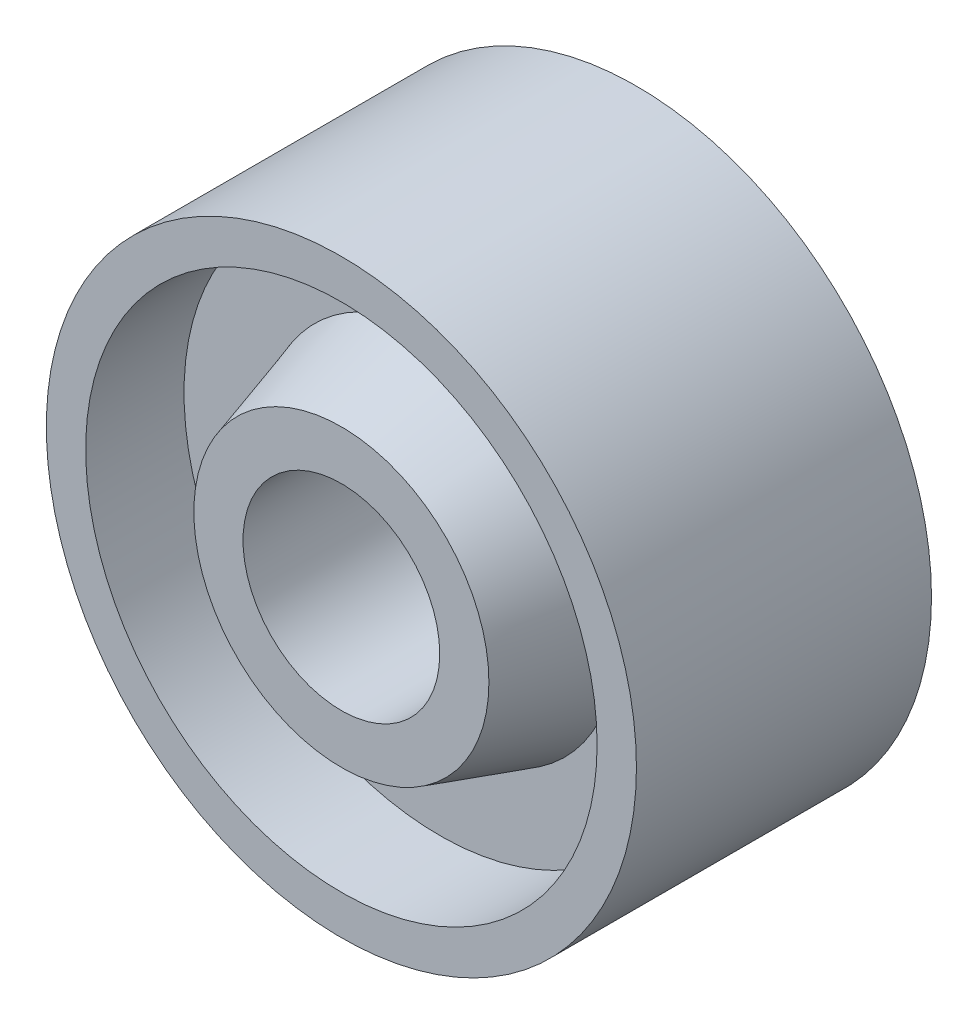
ISO-10303-21;
HEADER;
FILE_DESCRIPTION(('STEP AP214'),'2;1');
FILE_NAME('part.step','',(''),(''),'','','');
FILE_SCHEMA(('AUTOMOTIVE_DESIGN { 1 0 10303 214 1 1 1 1 }'));
ENDSEC;
DATA;
#1=APPLICATION_CONTEXT('core data for automotive mechanical design processes');
#2=APPLICATION_PROTOCOL_DEFINITION('international standard','automotive_design',2000,#1);
#3=PRODUCT_CONTEXT('',#1,'mechanical');
#4=PRODUCT('Part','Part','',(#3));
#5=PRODUCT_RELATED_PRODUCT_CATEGORY('part','',(#4));
#6=PRODUCT_DEFINITION_FORMATION('','',#4);
#7=PRODUCT_DEFINITION_CONTEXT('part definition',#1,'design');
#8=PRODUCT_DEFINITION('design','',#6,#7);
#9=PRODUCT_DEFINITION_SHAPE('','',#8);
#10=(LENGTH_UNIT() NAMED_UNIT(*) SI_UNIT(.MILLI.,.METRE.));
#11=(NAMED_UNIT(*) PLANE_ANGLE_UNIT() SI_UNIT($,.RADIAN.));
#12=(NAMED_UNIT(*) SI_UNIT($,.STERADIAN.) SOLID_ANGLE_UNIT());
#13=UNCERTAINTY_MEASURE_WITH_UNIT(LENGTH_MEASURE(1.E-05),#10,'distance_accuracy_value','');
#14=(GEOMETRIC_REPRESENTATION_CONTEXT(3) GLOBAL_UNCERTAINTY_ASSIGNED_CONTEXT((#13)) GLOBAL_UNIT_ASSIGNED_CONTEXT((#10,
#11,#12)) REPRESENTATION_CONTEXT('',''));
#15=CARTESIAN_POINT('',(0.,0.,0.));
#16=DIRECTION('',(0.,0.,1.));
#17=DIRECTION('',(1.,0.,0.));
#18=AXIS2_PLACEMENT_3D('',#15,#16,#17);
#19=CARTESIAN_POINT('',(0.,0.,-30.));
#20=DIRECTION('',(0.,0.,1.));
#21=DIRECTION('',(1.,0.,0.));
#22=AXIS2_PLACEMENT_3D('',#19,#20,#21);
#23=CYLINDRICAL_SURFACE('',#22,30.);
#24=CARTESIAN_POINT('',(0.,0.,-30.));
#25=DIRECTION('',(0.,0.,1.));
#26=DIRECTION('',(1.,0.,0.));
#27=AXIS2_PLACEMENT_3D('',#24,#25,#26);
#28=CIRCLE('',#27,30.);
#29=CARTESIAN_POINT('',(30.,0.,-30.));
#30=VERTEX_POINT('',#29);
#31=EDGE_CURVE('E10',#30,#30,#28,.T.);
#32=ORIENTED_EDGE('',*,*,#31,.T.);
#33=EDGE_LOOP('',(#32));
#34=FACE_BOUND('',#33,.T.);
#35=CARTESIAN_POINT('',(0.,0.,0.));
#36=DIRECTION('',(0.,0.,1.));
#37=DIRECTION('',(1.,0.,0.));
#38=AXIS2_PLACEMENT_3D('',#35,#36,#37);
#39=CIRCLE('',#38,30.);
#40=CARTESIAN_POINT('',(30.,0.,0.));
#41=VERTEX_POINT('',#40);
#42=EDGE_CURVE('E42',#41,#41,#39,.T.);
#43=ORIENTED_EDGE('',*,*,#42,.F.);
#44=EDGE_LOOP('',(#43));
#45=FACE_BOUND('',#44,.T.);
#46=ADVANCED_FACE('F39',(#34,#45),#23,.T.);
#47=CARTESIAN_POINT('',(0.,0.,-30.));
#48=DIRECTION('',(0.,0.,1.));
#49=DIRECTION('',(1.,0.,0.));
#50=AXIS2_PLACEMENT_3D('',#47,#48,#49);
#51=PLANE('',#50);
#52=CARTESIAN_POINT('',(0.,0.,-30.));
#53=DIRECTION('',(0.,0.,-1.));
#54=DIRECTION('',(-1.,0.,0.));
#55=AXIS2_PLACEMENT_3D('',#52,#53,#54);
#56=CIRCLE('',#55,26.);
#57=CARTESIAN_POINT('',(-26.,0.,-30.));
#58=VERTEX_POINT('',#57);
#59=EDGE_CURVE('E57',#58,#58,#56,.T.);
#60=ORIENTED_EDGE('',*,*,#59,.F.);
#61=EDGE_LOOP('',(#60));
#62=FACE_BOUND('',#61,.T.);
#63=ORIENTED_EDGE('',*,*,#31,.F.);
#64=EDGE_LOOP('',(#63));
#65=FACE_BOUND('',#64,.T.);
#66=ADVANCED_FACE('F96',(#62,#65),#51,.F.);
#67=CARTESIAN_POINT('',(0.,0.,0.));
#68=DIRECTION('',(0.,0.,1.));
#69=DIRECTION('',(1.,0.,0.));
#70=AXIS2_PLACEMENT_3D('',#67,#68,#69);
#71=PLANE('',#70);
#72=CARTESIAN_POINT('',(0.,0.,0.));
#73=DIRECTION('',(0.,0.,1.));
#74=DIRECTION('',(1.,0.,0.));
#75=AXIS2_PLACEMENT_3D('',#72,#73,#74);
#76=CIRCLE('',#75,26.);
#77=CARTESIAN_POINT('',(26.,0.,0.));
#78=VERTEX_POINT('',#77);
#79=EDGE_CURVE('E51',#78,#78,#76,.T.);
#80=ORIENTED_EDGE('',*,*,#79,.F.);
#81=EDGE_LOOP('',(#80));
#82=FACE_BOUND('',#81,.T.);
#83=ORIENTED_EDGE('',*,*,#42,.T.);
#84=EDGE_LOOP('',(#83));
#85=FACE_BOUND('',#84,.T.);
#86=ADVANCED_FACE('F100',(#82,#85),#71,.T.);
#87=CARTESIAN_POINT('',(0.,0.,-10.));
#88=DIRECTION('',(0.,0.,1.));
#89=DIRECTION('',(1.,0.,0.));
#90=AXIS2_PLACEMENT_3D('',#87,#88,#89);
#91=CYLINDRICAL_SURFACE('',#90,26.);
#92=CARTESIAN_POINT('',(0.,0.,-10.));
#93=DIRECTION('',(0.,0.,1.));
#94=DIRECTION('',(1.,0.,0.));
#95=AXIS2_PLACEMENT_3D('',#92,#93,#94);
#96=CIRCLE('',#95,26.);
#97=CARTESIAN_POINT('',(26.,0.,-10.));
#98=VERTEX_POINT('',#97);
#99=EDGE_CURVE('E49',#98,#98,#96,.T.);
#100=ORIENTED_EDGE('',*,*,#99,.F.);
#101=EDGE_LOOP('',(#100));
#102=FACE_BOUND('',#101,.T.);
#103=ORIENTED_EDGE('',*,*,#79,.T.);
#104=EDGE_LOOP('',(#103));
#105=FACE_BOUND('',#104,.T.);
#106=ADVANCED_FACE('F107',(#102,#105),#91,.F.);
#107=CARTESIAN_POINT('',(0.,0.,-10.));
#108=DIRECTION('',(0.,0.,1.));
#109=DIRECTION('',(1.,0.,0.));
#110=AXIS2_PLACEMENT_3D('',#107,#108,#109);
#111=PLANE('',#110);
#112=CARTESIAN_POINT('',(0.,0.,-10.));
#113=DIRECTION('',(0.,0.,1.));
#114=DIRECTION('',(1.,0.,0.));
#115=AXIS2_PLACEMENT_3D('',#112,#113,#114);
#116=CIRCLE('',#115,18.);
#117=CARTESIAN_POINT('',(18.,0.,-10.));
#118=VERTEX_POINT('',#117);
#119=EDGE_CURVE('E71',#118,#118,#116,.T.);
#120=ORIENTED_EDGE('',*,*,#119,.F.);
#121=EDGE_LOOP('',(#120));
#122=FACE_BOUND('',#121,.T.);
#123=ORIENTED_EDGE('',*,*,#99,.T.);
#124=EDGE_LOOP('',(#123));
#125=FACE_BOUND('',#124,.T.);
#126=ADVANCED_FACE('F112',(#122,#125),#111,.T.);
#127=CARTESIAN_POINT('',(0.,0.,-20.));
#128=DIRECTION('',(0.,0.,-1.));
#129=DIRECTION('',(-1.,0.,0.));
#130=AXIS2_PLACEMENT_3D('',#127,#128,#129);
#131=CYLINDRICAL_SURFACE('',#130,26.);
#132=CARTESIAN_POINT('',(0.,0.,-20.));
#133=DIRECTION('',(0.,0.,-1.));
#134=DIRECTION('',(-1.,0.,0.));
#135=AXIS2_PLACEMENT_3D('',#132,#133,#134);
#136=CIRCLE('',#135,26.);
#137=CARTESIAN_POINT('',(-26.,0.,-20.));
#138=VERTEX_POINT('',#137);
#139=EDGE_CURVE('E54',#138,#138,#136,.T.);
#140=ORIENTED_EDGE('',*,*,#139,.F.);
#141=EDGE_LOOP('',(#140));
#142=FACE_BOUND('',#141,.T.);
#143=ORIENTED_EDGE('',*,*,#59,.T.);
#144=EDGE_LOOP('',(#143));
#145=FACE_BOUND('',#144,.T.);
#146=ADVANCED_FACE('F119',(#142,#145),#131,.F.);
#147=CARTESIAN_POINT('',(0.,0.,-20.));
#148=DIRECTION('',(0.,0.,-1.));
#149=DIRECTION('',(-1.,0.,0.));
#150=AXIS2_PLACEMENT_3D('',#147,#148,#149);
#151=PLANE('',#150);
#152=CARTESIAN_POINT('',(0.,0.,-20.));
#153=DIRECTION('',(0.,0.,1.));
#154=DIRECTION('',(1.,0.,0.));
#155=AXIS2_PLACEMENT_3D('',#152,#153,#154);
#156=CIRCLE('',#155,18.);
#157=CARTESIAN_POINT('',(18.,0.,-20.));
#158=VERTEX_POINT('',#157);
#159=EDGE_CURVE('E77',#158,#158,#156,.T.);
#160=ORIENTED_EDGE('',*,*,#159,.T.);
#161=EDGE_LOOP('',(#160));
#162=FACE_BOUND('',#161,.T.);
#163=ORIENTED_EDGE('',*,*,#139,.T.);
#164=EDGE_LOOP('',(#163));
#165=FACE_BOUND('',#164,.T.);
#166=ADVANCED_FACE('F81',(#162,#165),#151,.T.);
#167=CARTESIAN_POINT('',(0.,0.,-20.));
#168=DIRECTION('',(0.,0.,1.));
#169=DIRECTION('',(1.,0.,0.));
#170=AXIS2_PLACEMENT_3D('',#167,#168,#169);
#171=CYLINDRICAL_SURFACE('',#170,10.);
#172=CARTESIAN_POINT('',(0.,0.,0.));
#173=DIRECTION('',(0.,0.,1.));
#174=DIRECTION('',(1.,0.,0.));
#175=AXIS2_PLACEMENT_3D('',#172,#173,#174);
#176=CIRCLE('',#175,10.);
#177=CARTESIAN_POINT('',(10.,0.,0.));
#178=VERTEX_POINT('',#177);
#179=EDGE_CURVE('E60',#178,#178,#176,.T.);
#180=ORIENTED_EDGE('',*,*,#179,.T.);
#181=EDGE_LOOP('',(#180));
#182=FACE_BOUND('',#181,.T.);
#183=CARTESIAN_POINT('',(0.,0.,-30.));
#184=DIRECTION('',(0.,0.,-1.));
#185=DIRECTION('',(-1.,0.,0.));
#186=AXIS2_PLACEMENT_3D('',#183,#184,#185);
#187=CIRCLE('',#186,10.);
#188=CARTESIAN_POINT('',(-10.,0.,-30.));
#189=VERTEX_POINT('',#188);
#190=EDGE_CURVE('E65',#189,#189,#187,.T.);
#191=ORIENTED_EDGE('',*,*,#190,.T.);
#192=EDGE_LOOP('',(#191));
#193=FACE_BOUND('',#192,.T.);
#194=ADVANCED_FACE('F126',(#182,#193),#171,.F.);
#195=CARTESIAN_POINT('',(0.,0.,0.));
#196=DIRECTION('',(0.,0.,1.));
#197=DIRECTION('',(1.,0.,0.));
#198=AXIS2_PLACEMENT_3D('',#195,#196,#197);
#199=PLANE('',#198);
#200=ORIENTED_EDGE('',*,*,#179,.F.);
#201=EDGE_LOOP('',(#200));
#202=FACE_BOUND('',#201,.T.);
#203=CARTESIAN_POINT('',(0.,0.,0.));
#204=DIRECTION('',(0.,0.,1.));
#205=DIRECTION('',(1.,0.,0.));
#206=AXIS2_PLACEMENT_3D('',#203,#204,#205);
#207=CIRCLE('',#206,15.);
#208=CARTESIAN_POINT('',(15.,0.,0.));
#209=VERTEX_POINT('',#208);
#210=EDGE_CURVE('E68',#209,#209,#207,.T.);
#211=ORIENTED_EDGE('',*,*,#210,.T.);
#212=EDGE_LOOP('',(#211));
#213=FACE_BOUND('',#212,.T.);
#214=ADVANCED_FACE('F129',(#202,#213),#199,.T.);
#215=CARTESIAN_POINT('',(0.,0.,-30.));
#216=DIRECTION('',(0.,0.,-1.));
#217=DIRECTION('',(-1.,0.,0.));
#218=AXIS2_PLACEMENT_3D('',#215,#216,#217);
#219=PLANE('',#218);
#220=ORIENTED_EDGE('',*,*,#190,.F.);
#221=EDGE_LOOP('',(#220));
#222=FACE_BOUND('',#221,.T.);
#223=CARTESIAN_POINT('',(0.,0.,-30.));
#224=DIRECTION('',(0.,0.,1.));
#225=DIRECTION('',(1.,0.,0.));
#226=AXIS2_PLACEMENT_3D('',#223,#224,#225);
#227=CIRCLE('',#226,15.);
#228=CARTESIAN_POINT('',(15.,0.,-30.));
#229=VERTEX_POINT('',#228);
#230=EDGE_CURVE('E74',#229,#229,#227,.T.);
#231=ORIENTED_EDGE('',*,*,#230,.F.);
#232=EDGE_LOOP('',(#231));
#233=FACE_BOUND('',#232,.T.);
#234=ADVANCED_FACE('F92',(#222,#233),#219,.T.);
#235=CARTESIAN_POINT('',(0.,0.,-10.));
#236=DIRECTION('',(0.,0.,-1.));
#237=DIRECTION('',(-1.,0.,0.));
#238=AXIS2_PLACEMENT_3D('',#235,#236,#237);
#239=CONICAL_SURFACE('',#238,18.,0.291456794477867);
#240=ORIENTED_EDGE('',*,*,#210,.F.);
#241=EDGE_LOOP('',(#240));
#242=FACE_BOUND('',#241,.T.);
#243=ORIENTED_EDGE('',*,*,#119,.T.);
#244=EDGE_LOOP('',(#243));
#245=FACE_BOUND('',#244,.T.);
#246=ADVANCED_FACE('F86',(#242,#245),#239,.T.);
#247=CARTESIAN_POINT('',(0.,0.,-20.));
#248=DIRECTION('',(0.,0.,1.));
#249=DIRECTION('',(-1.,0.,0.));
#250=AXIS2_PLACEMENT_3D('',#247,#248,#249);
#251=CONICAL_SURFACE('',#250,18.,0.291456794477867);
#252=ORIENTED_EDGE('',*,*,#230,.T.);
#253=EDGE_LOOP('',(#252));
#254=FACE_BOUND('',#253,.T.);
#255=ORIENTED_EDGE('',*,*,#159,.F.);
#256=EDGE_LOOP('',(#255));
#257=FACE_BOUND('',#256,.T.);
#258=ADVANCED_FACE('F84',(#254,#257),#251,.T.);
#259=CLOSED_SHELL('',(#46,#66,#86,#106,#126,#146,#166,#194,#214,#234,#246,#258));
#260=MANIFOLD_SOLID_BREP('B2',#259);
#261=ADVANCED_BREP_SHAPE_REPRESENTATION('',(#18,#260),#14);
#262=SHAPE_DEFINITION_REPRESENTATION(#9,#261);
ENDSEC;
END-ISO-10303-21;
